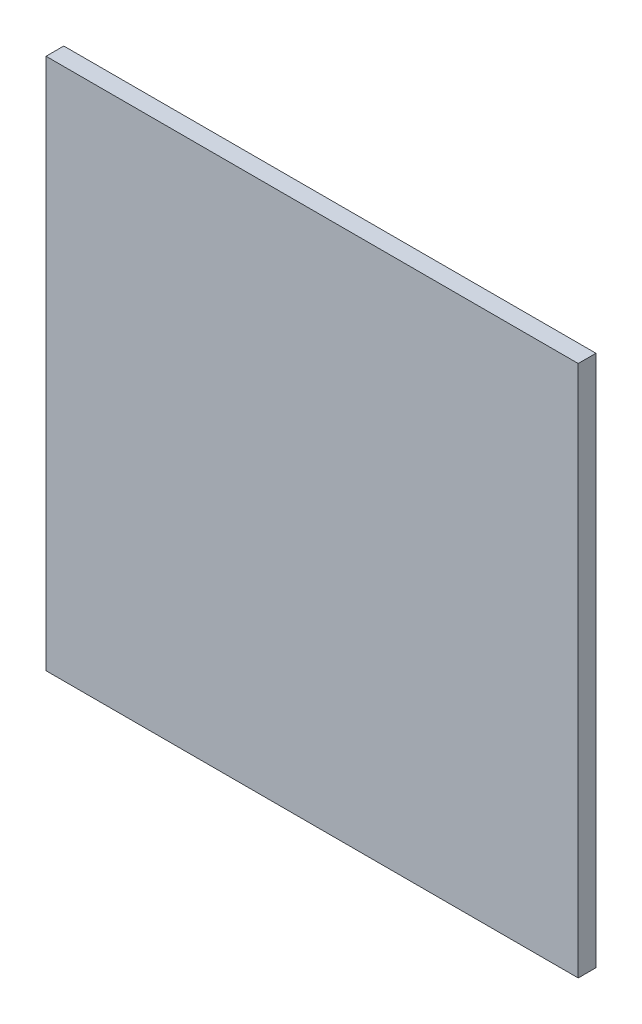
ISO-10303-21;
HEADER;
FILE_DESCRIPTION(('STEP AP214'),'2;1');
FILE_NAME('part.step','',(''),(''),'','','');
FILE_SCHEMA(('AUTOMOTIVE_DESIGN { 1 0 10303 214 1 1 1 1 }'));
ENDSEC;
DATA;
#1=APPLICATION_CONTEXT('core data for automotive mechanical design processes');
#2=APPLICATION_PROTOCOL_DEFINITION('international standard','automotive_design',2000,#1);
#3=PRODUCT_CONTEXT('',#1,'mechanical');
#4=PRODUCT('Part','Part','',(#3));
#5=PRODUCT_RELATED_PRODUCT_CATEGORY('part','',(#4));
#6=PRODUCT_DEFINITION_FORMATION('','',#4);
#7=PRODUCT_DEFINITION_CONTEXT('part definition',#1,'design');
#8=PRODUCT_DEFINITION('design','',#6,#7);
#9=PRODUCT_DEFINITION_SHAPE('','',#8);
#10=(LENGTH_UNIT() NAMED_UNIT(*) SI_UNIT(.MILLI.,.METRE.));
#11=(NAMED_UNIT(*) PLANE_ANGLE_UNIT() SI_UNIT($,.RADIAN.));
#12=(NAMED_UNIT(*) SI_UNIT($,.STERADIAN.) SOLID_ANGLE_UNIT());
#13=UNCERTAINTY_MEASURE_WITH_UNIT(LENGTH_MEASURE(1.E-05),#10,'distance_accuracy_value','');
#14=(GEOMETRIC_REPRESENTATION_CONTEXT(3) GLOBAL_UNCERTAINTY_ASSIGNED_CONTEXT((#13)) GLOBAL_UNIT_ASSIGNED_CONTEXT((#10,
#11,#12)) REPRESENTATION_CONTEXT('',''));
#15=CARTESIAN_POINT('',(0.,0.,0.));
#16=DIRECTION('',(0.,0.,1.));
#17=DIRECTION('',(1.,0.,0.));
#18=AXIS2_PLACEMENT_3D('',#15,#16,#17);
#19=CARTESIAN_POINT('',(0.,0.,4.));
#20=DIRECTION('',(1.,0.,0.));
#21=DIRECTION('',(0.,0.,-1.));
#22=AXIS2_PLACEMENT_3D('',#19,#20,#21);
#23=PLANE('',#22);
#24=DIRECTION('',(0.,-1.,0.));
#25=VECTOR('',#24,1.);
#26=CARTESIAN_POINT('',(0.,0.,0.));
#27=LINE('',#26,#25);
#28=CARTESIAN_POINT('',(0.,120.,0.));
#29=VERTEX_POINT('',#28);
#30=CARTESIAN_POINT('',(0.,0.,0.));
#31=VERTEX_POINT('',#30);
#32=EDGE_CURVE('E102',#29,#31,#27,.T.);
#33=ORIENTED_EDGE('',*,*,#32,.T.);
#34=DIRECTION('',(0.,0.,-1.));
#35=VECTOR('',#34,1.);
#36=CARTESIAN_POINT('',(0.,0.,4.));
#37=LINE('',#36,#35);
#38=CARTESIAN_POINT('',(0.,0.,4.));
#39=VERTEX_POINT('',#38);
#40=EDGE_CURVE('E11',#39,#31,#37,.T.);
#41=ORIENTED_EDGE('',*,*,#40,.F.);
#42=DIRECTION('',(0.,-1.,0.));
#43=VECTOR('',#42,1.);
#44=CARTESIAN_POINT('',(0.,0.,4.));
#45=LINE('',#44,#43);
#46=CARTESIAN_POINT('',(0.,120.,4.));
#47=VERTEX_POINT('',#46);
#48=EDGE_CURVE('E90',#47,#39,#45,.T.);
#49=ORIENTED_EDGE('',*,*,#48,.F.);
#50=DIRECTION('',(0.,0.,-1.));
#51=VECTOR('',#50,1.);
#52=CARTESIAN_POINT('',(0.,120.,4.));
#53=LINE('',#52,#51);
#54=EDGE_CURVE('E98',#47,#29,#53,.T.);
#55=ORIENTED_EDGE('',*,*,#54,.T.);
#56=EDGE_LOOP('',(#33,#41,#49,#55));
#57=FACE_BOUND('',#56,.T.);
#58=ADVANCED_FACE('F39',(#57),#23,.F.);
#59=CARTESIAN_POINT('',(0.,0.,4.));
#60=DIRECTION('',(0.,1.,0.));
#61=DIRECTION('',(0.,0.,1.));
#62=AXIS2_PLACEMENT_3D('',#59,#60,#61);
#63=PLANE('',#62);
#64=DIRECTION('',(1.,0.,0.));
#65=VECTOR('',#64,1.);
#66=CARTESIAN_POINT('',(0.,0.,0.));
#67=LINE('',#66,#65);
#68=CARTESIAN_POINT('',(120.,0.,0.));
#69=VERTEX_POINT('',#68);
#70=EDGE_CURVE('E94',#31,#69,#67,.T.);
#71=ORIENTED_EDGE('',*,*,#70,.T.);
#72=DIRECTION('',(0.,0.,-1.));
#73=VECTOR('',#72,1.);
#74=CARTESIAN_POINT('',(120.,0.,4.));
#75=LINE('',#74,#73);
#76=CARTESIAN_POINT('',(120.,0.,4.));
#77=VERTEX_POINT('',#76);
#78=EDGE_CURVE('E47',#77,#69,#75,.T.);
#79=ORIENTED_EDGE('',*,*,#78,.F.);
#80=DIRECTION('',(1.,0.,0.));
#81=VECTOR('',#80,1.);
#82=CARTESIAN_POINT('',(0.,0.,4.));
#83=LINE('',#82,#81);
#84=EDGE_CURVE('E85',#39,#77,#83,.T.);
#85=ORIENTED_EDGE('',*,*,#84,.F.);
#86=ORIENTED_EDGE('',*,*,#40,.T.);
#87=EDGE_LOOP('',(#71,#79,#85,#86));
#88=FACE_BOUND('',#87,.T.);
#89=ADVANCED_FACE('F93',(#88),#63,.F.);
#90=CARTESIAN_POINT('',(120.,0.,4.));
#91=DIRECTION('',(-1.,0.,0.));
#92=DIRECTION('',(0.,0.,1.));
#93=AXIS2_PLACEMENT_3D('',#90,#91,#92);
#94=PLANE('',#93);
#95=DIRECTION('',(0.,1.,0.));
#96=VECTOR('',#95,1.);
#97=CARTESIAN_POINT('',(120.,0.,0.));
#98=LINE('',#97,#96);
#99=CARTESIAN_POINT('',(120.,120.,0.));
#100=VERTEX_POINT('',#99);
#101=EDGE_CURVE('E72',#69,#100,#98,.T.);
#102=ORIENTED_EDGE('',*,*,#101,.T.);
#103=DIRECTION('',(0.,0.,-1.));
#104=VECTOR('',#103,1.);
#105=CARTESIAN_POINT('',(120.,120.,4.));
#106=LINE('',#105,#104);
#107=CARTESIAN_POINT('',(120.,120.,4.));
#108=VERTEX_POINT('',#107);
#109=EDGE_CURVE('E95',#108,#100,#106,.T.);
#110=ORIENTED_EDGE('',*,*,#109,.F.);
#111=DIRECTION('',(0.,1.,0.));
#112=VECTOR('',#111,1.);
#113=CARTESIAN_POINT('',(120.,0.,4.));
#114=LINE('',#113,#112);
#115=EDGE_CURVE('E88',#77,#108,#114,.T.);
#116=ORIENTED_EDGE('',*,*,#115,.F.);
#117=ORIENTED_EDGE('',*,*,#78,.T.);
#118=EDGE_LOOP('',(#102,#110,#116,#117));
#119=FACE_BOUND('',#118,.T.);
#120=ADVANCED_FACE('F96',(#119),#94,.F.);
#121=CARTESIAN_POINT('',(0.,120.,4.));
#122=DIRECTION('',(0.,-1.,0.));
#123=DIRECTION('',(0.,0.,-1.));
#124=AXIS2_PLACEMENT_3D('',#121,#122,#123);
#125=PLANE('',#124);
#126=DIRECTION('',(-1.,0.,0.));
#127=VECTOR('',#126,1.);
#128=CARTESIAN_POINT('',(0.,120.,0.));
#129=LINE('',#128,#127);
#130=EDGE_CURVE('E78',#100,#29,#129,.T.);
#131=ORIENTED_EDGE('',*,*,#130,.T.);
#132=ORIENTED_EDGE('',*,*,#54,.F.);
#133=DIRECTION('',(-1.,0.,0.));
#134=VECTOR('',#133,1.);
#135=CARTESIAN_POINT('',(0.,120.,4.));
#136=LINE('',#135,#134);
#137=EDGE_CURVE('E55',#108,#47,#136,.T.);
#138=ORIENTED_EDGE('',*,*,#137,.F.);
#139=ORIENTED_EDGE('',*,*,#109,.T.);
#140=EDGE_LOOP('',(#131,#132,#138,#139));
#141=FACE_BOUND('',#140,.T.);
#142=ADVANCED_FACE('F109',(#141),#125,.F.);
#143=CARTESIAN_POINT('',(0.,0.,4.));
#144=DIRECTION('',(0.,0.,-1.));
#145=DIRECTION('',(-1.,0.,0.));
#146=AXIS2_PLACEMENT_3D('',#143,#144,#145);
#147=PLANE('',#146);
#148=ORIENTED_EDGE('',*,*,#48,.T.);
#149=ORIENTED_EDGE('',*,*,#84,.T.);
#150=ORIENTED_EDGE('',*,*,#115,.T.);
#151=ORIENTED_EDGE('',*,*,#137,.T.);
#152=EDGE_LOOP('',(#148,#149,#150,#151));
#153=FACE_BOUND('',#152,.T.);
#154=ADVANCED_FACE('F86',(#153),#147,.F.);
#155=CARTESIAN_POINT('',(0.,0.,0.));
#156=DIRECTION('',(0.,0.,-1.));
#157=DIRECTION('',(-1.,0.,0.));
#158=AXIS2_PLACEMENT_3D('',#155,#156,#157);
#159=PLANE('',#158);
#160=ORIENTED_EDGE('',*,*,#32,.F.);
#161=ORIENTED_EDGE('',*,*,#130,.F.);
#162=ORIENTED_EDGE('',*,*,#101,.F.);
#163=ORIENTED_EDGE('',*,*,#70,.F.);
#164=EDGE_LOOP('',(#160,#161,#162,#163));
#165=FACE_BOUND('',#164,.T.);
#166=ADVANCED_FACE('F112',(#165),#159,.T.);
#167=CLOSED_SHELL('',(#58,#89,#120,#142,#154,#166));
#168=MANIFOLD_SOLID_BREP('B2',#167);
#169=ADVANCED_BREP_SHAPE_REPRESENTATION('',(#18,#168),#14);
#170=SHAPE_DEFINITION_REPRESENTATION(#9,#169);
ENDSEC;
END-ISO-10303-21;
